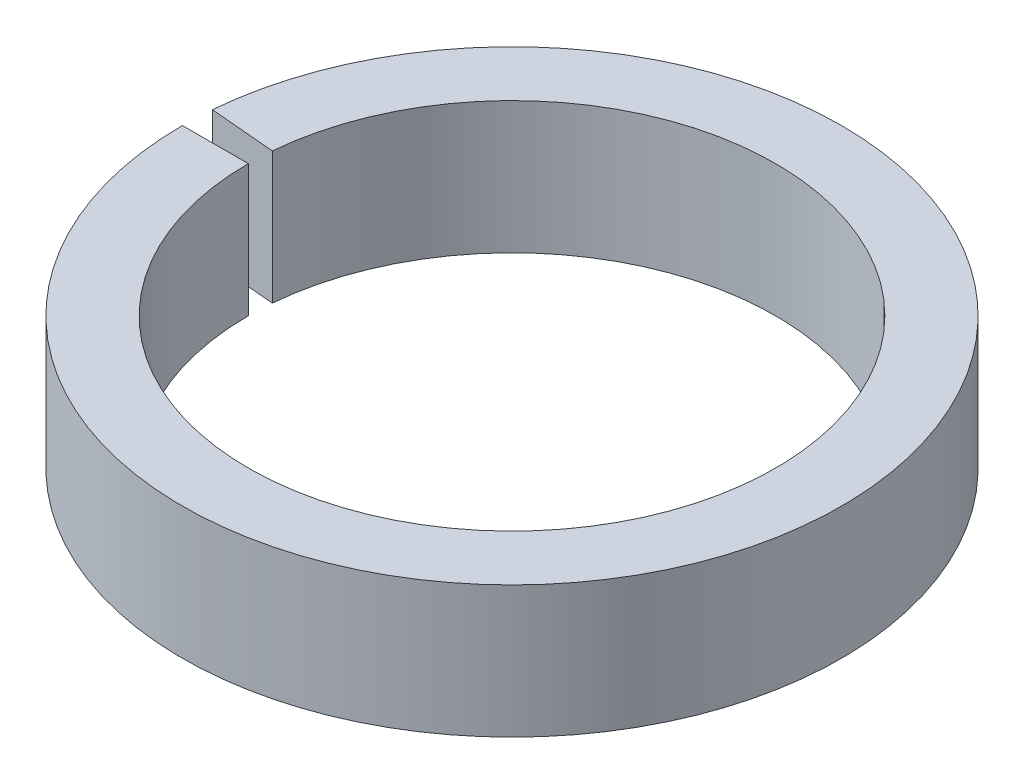
ISO-10303-21;
HEADER;
FILE_DESCRIPTION(('STEP AP214'),'2;1');
FILE_NAME('part.step','',(''),(''),'','','');
FILE_SCHEMA(('AUTOMOTIVE_DESIGN { 1 0 10303 214 1 1 1 1 }'));
ENDSEC;
DATA;
#1=APPLICATION_CONTEXT('core data for automotive mechanical design processes');
#2=APPLICATION_PROTOCOL_DEFINITION('international standard','automotive_design',2000,#1);
#3=PRODUCT_CONTEXT('',#1,'mechanical');
#4=PRODUCT('Part','Part','',(#3));
#5=PRODUCT_RELATED_PRODUCT_CATEGORY('part','',(#4));
#6=PRODUCT_DEFINITION_FORMATION('','',#4);
#7=PRODUCT_DEFINITION_CONTEXT('part definition',#1,'design');
#8=PRODUCT_DEFINITION('design','',#6,#7);
#9=PRODUCT_DEFINITION_SHAPE('','',#8);
#10=(LENGTH_UNIT() NAMED_UNIT(*) SI_UNIT(.MILLI.,.METRE.));
#11=(NAMED_UNIT(*) PLANE_ANGLE_UNIT() SI_UNIT($,.RADIAN.));
#12=(NAMED_UNIT(*) SI_UNIT($,.STERADIAN.) SOLID_ANGLE_UNIT());
#13=UNCERTAINTY_MEASURE_WITH_UNIT(LENGTH_MEASURE(1.E-05),#10,'distance_accuracy_value','');
#14=(GEOMETRIC_REPRESENTATION_CONTEXT(3) GLOBAL_UNCERTAINTY_ASSIGNED_CONTEXT((#13)) GLOBAL_UNIT_ASSIGNED_CONTEXT((#10,
#11,#12)) REPRESENTATION_CONTEXT('',''));
#15=CARTESIAN_POINT('',(0.,0.,0.));
#16=DIRECTION('',(0.,0.,1.));
#17=DIRECTION('',(1.,0.,0.));
#18=AXIS2_PLACEMENT_3D('',#15,#16,#17);
#19=CARTESIAN_POINT('',(0.,0.,0.));
#20=DIRECTION('',(0.,-1.,0.));
#21=DIRECTION('',(0.,0.,-1.));
#22=AXIS2_PLACEMENT_3D('',#19,#20,#21);
#23=CYLINDRICAL_SURFACE('',#22,7.9375);
#24=CARTESIAN_POINT('',(0.,3.175,0.));
#25=DIRECTION('',(0.,-1.,0.));
#26=DIRECTION('',(0.,0.,-1.));
#27=AXIS2_PLACEMENT_3D('',#24,#25,#26);
#28=CIRCLE('',#27,7.9375);
#29=CARTESIAN_POINT('',(-7.90729541610324,3.175,-0.691798708059432));
#30=VERTEX_POINT('',#29);
#31=CARTESIAN_POINT('',(-7.9375,3.175,0.));
#32=VERTEX_POINT('',#31);
#33=EDGE_CURVE('E11',#30,#32,#28,.T.);
#34=ORIENTED_EDGE('',*,*,#33,.T.);
#35=DIRECTION('',(0.,-1.,0.));
#36=VECTOR('',#35,1.);
#37=CARTESIAN_POINT('',(-7.9375,0.,0.));
#38=LINE('',#37,#36);
#39=CARTESIAN_POINT('',(-7.9375,0.,0.));
#40=VERTEX_POINT('',#39);
#41=EDGE_CURVE('E92',#32,#40,#38,.T.);
#42=ORIENTED_EDGE('',*,*,#41,.T.);
#43=CARTESIAN_POINT('',(0.,0.,0.));
#44=DIRECTION('',(0.,-1.,0.));
#45=DIRECTION('',(0.,0.,-1.));
#46=AXIS2_PLACEMENT_3D('',#43,#44,#45);
#47=CIRCLE('',#46,7.9375);
#48=CARTESIAN_POINT('',(-7.90729541610324,0.,-0.691798708059432));
#49=VERTEX_POINT('',#48);
#50=EDGE_CURVE('E74',#49,#40,#47,.T.);
#51=ORIENTED_EDGE('',*,*,#50,.F.);
#52=DIRECTION('',(0.,-1.,0.));
#53=VECTOR('',#52,1.);
#54=CARTESIAN_POINT('',(-7.90729541610324,0.,-0.691798708059432));
#55=LINE('',#54,#53);
#56=EDGE_CURVE('E100',#30,#49,#55,.T.);
#57=ORIENTED_EDGE('',*,*,#56,.F.);
#58=EDGE_LOOP('',(#34,#42,#51,#57));
#59=FACE_BOUND('',#58,.T.);
#60=ADVANCED_FACE('F34',(#59),#23,.T.);
#61=CARTESIAN_POINT('',(-7.90729541610324,3.175,-0.691798708059432));
#62=DIRECTION('',(0.,-1.,0.));
#63=DIRECTION('',(0.,0.,-1.));
#64=AXIS2_PLACEMENT_3D('',#61,#62,#63);
#65=PLANE('',#64);
#66=CARTESIAN_POINT('',(0.,3.175,0.));
#67=DIRECTION('',(0.,-1.,0.));
#68=DIRECTION('',(0.,0.,-1.));
#69=AXIS2_PLACEMENT_3D('',#66,#67,#68);
#70=CIRCLE('',#69,6.35);
#71=CARTESIAN_POINT('',(-6.32583633288259,3.175,-0.553438966447546));
#72=VERTEX_POINT('',#71);
#73=CARTESIAN_POINT('',(-6.35,3.175,0.));
#74=VERTEX_POINT('',#73);
#75=EDGE_CURVE('E42',#72,#74,#70,.T.);
#76=ORIENTED_EDGE('',*,*,#75,.T.);
#77=DIRECTION('',(-1.,0.,0.));
#78=VECTOR('',#77,1.);
#79=CARTESIAN_POINT('',(-7.9375,3.175,0.));
#80=LINE('',#79,#78);
#81=EDGE_CURVE('E98',#74,#32,#80,.T.);
#82=ORIENTED_EDGE('',*,*,#81,.T.);
#83=ORIENTED_EDGE('',*,*,#33,.F.);
#84=DIRECTION('',(-0.996194698091747,0.,-0.087155742747645));
#85=VECTOR('',#84,1.);
#86=CARTESIAN_POINT('',(-7.90729541610324,3.175,-0.691798708059432));
#87=LINE('',#86,#85);
#88=EDGE_CURVE('E86',#72,#30,#87,.T.);
#89=ORIENTED_EDGE('',*,*,#88,.F.);
#90=EDGE_LOOP('',(#76,#82,#83,#89));
#91=FACE_BOUND('',#90,.T.);
#92=ADVANCED_FACE('F36',(#91),#65,.F.);
#93=CARTESIAN_POINT('',(0.,0.,0.));
#94=DIRECTION('',(0.,-1.,0.));
#95=DIRECTION('',(0.,0.,-1.));
#96=AXIS2_PLACEMENT_3D('',#93,#94,#95);
#97=CYLINDRICAL_SURFACE('',#96,6.35);
#98=CARTESIAN_POINT('',(0.,0.,0.));
#99=DIRECTION('',(0.,-1.,0.));
#100=DIRECTION('',(0.,0.,-1.));
#101=AXIS2_PLACEMENT_3D('',#98,#99,#100);
#102=CIRCLE('',#101,6.35);
#103=CARTESIAN_POINT('',(-6.32583633288259,0.,-0.553438966447546));
#104=VERTEX_POINT('',#103);
#105=CARTESIAN_POINT('',(-6.35,0.,0.));
#106=VERTEX_POINT('',#105);
#107=EDGE_CURVE('E85',#104,#106,#102,.T.);
#108=ORIENTED_EDGE('',*,*,#107,.T.);
#109=DIRECTION('',(0.,1.,0.));
#110=VECTOR('',#109,1.);
#111=CARTESIAN_POINT('',(-6.35,0.,0.));
#112=LINE('',#111,#110);
#113=EDGE_CURVE('E93',#106,#74,#112,.T.);
#114=ORIENTED_EDGE('',*,*,#113,.T.);
#115=ORIENTED_EDGE('',*,*,#75,.F.);
#116=DIRECTION('',(0.,1.,0.));
#117=VECTOR('',#116,1.);
#118=CARTESIAN_POINT('',(-6.32583633288259,0.,-0.553438966447546));
#119=LINE('',#118,#117);
#120=EDGE_CURVE('E103',#104,#72,#119,.T.);
#121=ORIENTED_EDGE('',*,*,#120,.F.);
#122=EDGE_LOOP('',(#108,#114,#115,#121));
#123=FACE_BOUND('',#122,.T.);
#124=ADVANCED_FACE('F106',(#123),#97,.F.);
#125=CARTESIAN_POINT('',(-7.90729541610324,0.,-0.691798708059432));
#126=DIRECTION('',(0.,1.,0.));
#127=DIRECTION('',(0.,0.,1.));
#128=AXIS2_PLACEMENT_3D('',#125,#126,#127);
#129=PLANE('',#128);
#130=DIRECTION('',(0.996194698091747,0.,0.087155742747645));
#131=VECTOR('',#130,1.);
#132=CARTESIAN_POINT('',(-7.90729541610324,0.,-0.691798708059432));
#133=LINE('',#132,#131);
#134=EDGE_CURVE('E80',#49,#104,#133,.T.);
#135=ORIENTED_EDGE('',*,*,#134,.F.);
#136=ORIENTED_EDGE('',*,*,#50,.T.);
#137=DIRECTION('',(1.,0.,0.));
#138=VECTOR('',#137,1.);
#139=CARTESIAN_POINT('',(-7.9375,0.,0.));
#140=LINE('',#139,#138);
#141=EDGE_CURVE('E77',#40,#106,#140,.T.);
#142=ORIENTED_EDGE('',*,*,#141,.T.);
#143=ORIENTED_EDGE('',*,*,#107,.F.);
#144=EDGE_LOOP('',(#135,#136,#142,#143));
#145=FACE_BOUND('',#144,.T.);
#146=ADVANCED_FACE('F76',(#145),#129,.F.);
#147=CARTESIAN_POINT('',(0.,0.,0.));
#148=DIRECTION('',(0.087155742747645,0.,-0.996194698091747));
#149=DIRECTION('',(-0.996194698091747,0.,-0.087155742747645));
#150=AXIS2_PLACEMENT_3D('',#147,#148,#149);
#151=PLANE('',#150);
#152=ORIENTED_EDGE('',*,*,#56,.T.);
#153=ORIENTED_EDGE('',*,*,#134,.T.);
#154=ORIENTED_EDGE('',*,*,#120,.T.);
#155=ORIENTED_EDGE('',*,*,#88,.T.);
#156=EDGE_LOOP('',(#152,#153,#154,#155));
#157=FACE_BOUND('',#156,.T.);
#158=ADVANCED_FACE('F108',(#157),#151,.F.);
#159=CARTESIAN_POINT('',(0.,0.,0.));
#160=DIRECTION('',(0.,0.,-1.));
#161=DIRECTION('',(-1.,0.,0.));
#162=AXIS2_PLACEMENT_3D('',#159,#160,#161);
#163=PLANE('',#162);
#164=ORIENTED_EDGE('',*,*,#41,.F.);
#165=ORIENTED_EDGE('',*,*,#81,.F.);
#166=ORIENTED_EDGE('',*,*,#113,.F.);
#167=ORIENTED_EDGE('',*,*,#141,.F.);
#168=EDGE_LOOP('',(#164,#165,#166,#167));
#169=FACE_BOUND('',#168,.T.);
#170=ADVANCED_FACE('F90',(#169),#163,.T.);
#171=CLOSED_SHELL('',(#60,#92,#124,#146,#158,#170));
#172=MANIFOLD_SOLID_BREP('B2',#171);
#173=ADVANCED_BREP_SHAPE_REPRESENTATION('',(#18,#172),#14);
#174=SHAPE_DEFINITION_REPRESENTATION(#9,#173);
ENDSEC;
END-ISO-10303-21;
